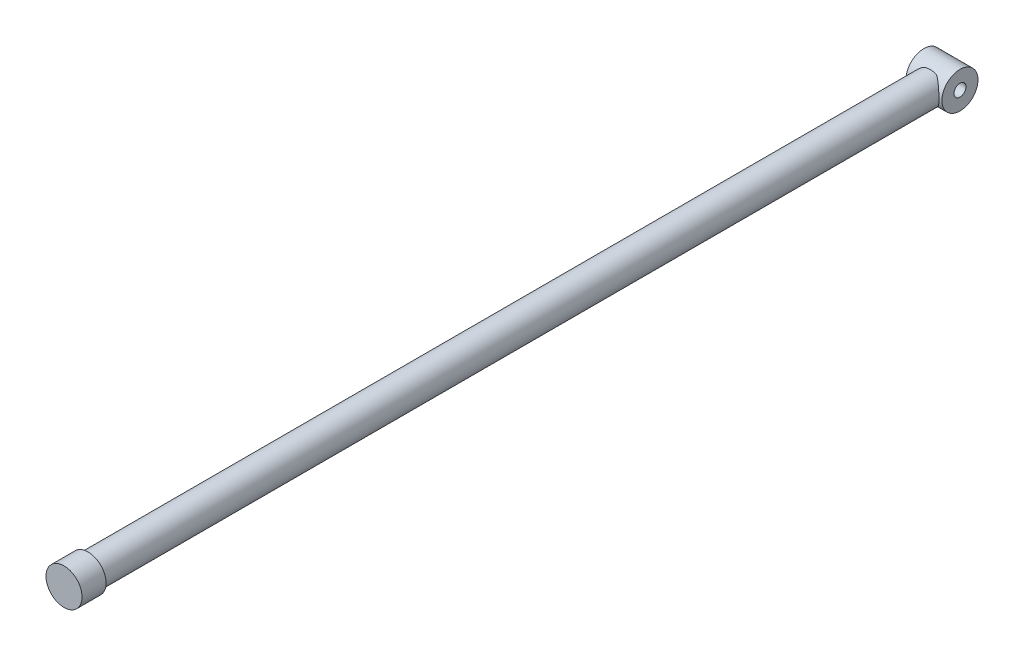
ISO-10303-21;
HEADER;
FILE_DESCRIPTION(('STEP AP214'),'2;1');
FILE_NAME('part.step','',(''),(''),'','','');
FILE_SCHEMA(('AUTOMOTIVE_DESIGN { 1 0 10303 214 1 1 1 1 }'));
ENDSEC;
DATA;
#1=APPLICATION_CONTEXT('core data for automotive mechanical design processes');
#2=APPLICATION_PROTOCOL_DEFINITION('international standard','automotive_design',2000,#1);
#3=PRODUCT_CONTEXT('',#1,'mechanical');
#4=PRODUCT('Part','Part','',(#3));
#5=PRODUCT_RELATED_PRODUCT_CATEGORY('part','',(#4));
#6=PRODUCT_DEFINITION_FORMATION('','',#4);
#7=PRODUCT_DEFINITION_CONTEXT('part definition',#1,'design');
#8=PRODUCT_DEFINITION('design','',#6,#7);
#9=PRODUCT_DEFINITION_SHAPE('','',#8);
#10=(LENGTH_UNIT() NAMED_UNIT(*) SI_UNIT(.MILLI.,.METRE.));
#11=(NAMED_UNIT(*) PLANE_ANGLE_UNIT() SI_UNIT($,.RADIAN.));
#12=(NAMED_UNIT(*) SI_UNIT($,.STERADIAN.) SOLID_ANGLE_UNIT());
#13=UNCERTAINTY_MEASURE_WITH_UNIT(LENGTH_MEASURE(1.E-05),#10,'distance_accuracy_value','');
#14=(GEOMETRIC_REPRESENTATION_CONTEXT(3) GLOBAL_UNCERTAINTY_ASSIGNED_CONTEXT((#13)) GLOBAL_UNIT_ASSIGNED_CONTEXT((#10,
#11,#12)) REPRESENTATION_CONTEXT('',''));
#15=CARTESIAN_POINT('',(0.,0.,0.));
#16=DIRECTION('',(0.,0.,1.));
#17=DIRECTION('',(1.,0.,0.));
#18=AXIS2_PLACEMENT_3D('',#15,#16,#17);
#19=CARTESIAN_POINT('',(0.,0.,-71.));
#20=DIRECTION('',(0.,0.,-1.));
#21=DIRECTION('',(-1.,0.,0.));
#22=AXIS2_PLACEMENT_3D('',#19,#20,#21);
#23=PLANE('',#22);
#24=DIRECTION('',(1.,0.,0.));
#25=VECTOR('',#24,1.);
#26=CARTESIAN_POINT('',(-1.5,1.1180339887499,-71.));
#27=LINE('',#26,#25);
#28=CARTESIAN_POINT('',(-0.559016994374931,1.1180339887499,-71.));
#29=VERTEX_POINT('',#28);
#30=CARTESIAN_POINT('',(0.559016994374931,1.1180339887499,-71.));
#31=VERTEX_POINT('',#30);
#32=EDGE_CURVE('E11',#29,#31,#27,.T.);
#33=ORIENTED_EDGE('',*,*,#32,.F.);
#34=CARTESIAN_POINT('',(0.,0.,-71.));
#35=DIRECTION('',(0.,0.,-1.));
#36=DIRECTION('',(-1.,0.,0.));
#37=AXIS2_PLACEMENT_3D('',#34,#35,#36);
#38=CIRCLE('',#37,1.25);
#39=EDGE_CURVE('E76',#29,#31,#38,.T.);
#40=ORIENTED_EDGE('',*,*,#39,.T.);
#41=EDGE_LOOP('',(#33,#40));
#42=FACE_BOUND('',#41,.T.);
#43=ADVANCED_FACE('F45',(#42),#23,.T.);
#44=CARTESIAN_POINT('',(0.,0.,1.));
#45=DIRECTION('',(0.,0.,-1.));
#46=DIRECTION('',(-1.,0.,0.));
#47=AXIS2_PLACEMENT_3D('',#44,#45,#46);
#48=CYLINDRICAL_SURFACE('',#47,1.5);
#49=CARTESIAN_POINT('',(0.,0.,1.));
#50=DIRECTION('',(0.,0.,1.));
#51=DIRECTION('',(1.,0.,0.));
#52=AXIS2_PLACEMENT_3D('',#49,#50,#51);
#53=CIRCLE('',#52,1.5);
#54=CARTESIAN_POINT('',(1.5,0.,1.));
#55=VERTEX_POINT('',#54);
#56=EDGE_CURVE('E92',#55,#55,#53,.T.);
#57=ORIENTED_EDGE('',*,*,#56,.F.);
#58=EDGE_LOOP('',(#57));
#59=FACE_BOUND('',#58,.T.);
#60=CARTESIAN_POINT('',(0.,0.,-1.));
#61=DIRECTION('',(0.,0.,1.));
#62=DIRECTION('',(1.,0.,0.));
#63=AXIS2_PLACEMENT_3D('',#60,#61,#62);
#64=CIRCLE('',#63,1.5);
#65=CARTESIAN_POINT('',(1.5,0.,-1.));
#66=VERTEX_POINT('',#65);
#67=EDGE_CURVE('E95',#66,#66,#64,.T.);
#68=ORIENTED_EDGE('',*,*,#67,.T.);
#69=EDGE_LOOP('',(#68));
#70=FACE_BOUND('',#69,.T.);
#71=ADVANCED_FACE('F47',(#59,#70),#48,.T.);
#72=CARTESIAN_POINT('',(0.,0.,1.));
#73=DIRECTION('',(0.,0.,1.));
#74=DIRECTION('',(1.,0.,0.));
#75=AXIS2_PLACEMENT_3D('',#72,#73,#74);
#76=PLANE('',#75);
#77=ORIENTED_EDGE('',*,*,#56,.T.);
#78=EDGE_LOOP('',(#77));
#79=FACE_BOUND('',#78,.T.);
#80=ADVANCED_FACE('F135',(#79),#76,.T.);
#81=CARTESIAN_POINT('',(0.,0.,-1.));
#82=DIRECTION('',(0.,0.,1.));
#83=DIRECTION('',(1.,0.,0.));
#84=AXIS2_PLACEMENT_3D('',#81,#82,#83);
#85=PLANE('',#84);
#86=CARTESIAN_POINT('',(0.,0.,-1.));
#87=DIRECTION('',(0.,0.,-1.));
#88=DIRECTION('',(-1.,0.,0.));
#89=AXIS2_PLACEMENT_3D('',#86,#87,#88);
#90=CIRCLE('',#89,1.25);
#91=CARTESIAN_POINT('',(-1.25,0.,-1.));
#92=VERTEX_POINT('',#91);
#93=EDGE_CURVE('E89',#92,#92,#90,.T.);
#94=ORIENTED_EDGE('',*,*,#93,.F.);
#95=EDGE_LOOP('',(#94));
#96=FACE_BOUND('',#95,.T.);
#97=ORIENTED_EDGE('',*,*,#67,.F.);
#98=EDGE_LOOP('',(#97));
#99=FACE_BOUND('',#98,.T.);
#100=ADVANCED_FACE('F129',(#96,#99),#85,.F.);
#101=CARTESIAN_POINT('',(0.,0.,-71.));
#102=DIRECTION('',(0.,0.,1.));
#103=DIRECTION('',(1.,0.,0.));
#104=AXIS2_PLACEMENT_3D('',#101,#102,#103);
#105=CYLINDRICAL_SURFACE('',#104,1.25);
#106=CARTESIAN_POINT('',(0.559016994374931,-1.1180339887499,-71.));
#107=VERTEX_POINT('',#106);
#108=CARTESIAN_POINT('',(-0.559016994374931,-1.1180339887499,-71.));
#109=VERTEX_POINT('',#108);
#110=EDGE_CURVE('E72',#107,#109,#38,.T.);
#111=ORIENTED_EDGE('',*,*,#110,.F.);
#112=CARTESIAN_POINT('',(0.559016994374931,-1.1180339887499,-71.));
#113=CARTESIAN_POINT('',(0.593811635344597,-1.10061806442588,-70.9805132598228));
#114=CARTESIAN_POINT('',(0.627533050357169,-1.08174407638237,-70.9604499757101));
#115=CARTESIAN_POINT('',(0.692870066810295,-1.0411161683683,-70.9197707023673));
#116=CARTESIAN_POINT('',(0.724484699822695,-1.01936093751207,-70.8991544649842));
#117=CARTESIAN_POINT('',(0.785860465048289,-0.972838228553443,-70.8578246726395));
#118=CARTESIAN_POINT('',(0.81560483316899,-0.948048143409763,-70.837111650001));
#119=CARTESIAN_POINT('',(0.872862085988988,-0.89561111579206,-70.7962619451478));
#120=CARTESIAN_POINT('',(0.900375568406183,-0.867964943089832,-70.7761251094982));
#121=CARTESIAN_POINT('',(0.969875806533156,-0.791188294761078,-70.7243325845818));
#122=CARTESIAN_POINT('',(1.00987496618825,-0.739618990336229,-70.6935397985703));
#123=CARTESIAN_POINT('',(1.08215411508672,-0.629108316130042,-70.6368936361563));
#124=CARTESIAN_POINT('',(1.11446004304221,-0.57019276924534,-70.6110237226948));
#125=CARTESIAN_POINT('',(1.16472101850465,-0.457178395897959,-70.5703495337047));
#126=CARTESIAN_POINT('',(1.18422337211217,-0.404191329565808,-70.5543847229982));
#127=CARTESIAN_POINT('',(1.21609063067817,-0.294731192199186,-70.5281665089475));
#128=CARTESIAN_POINT('',(1.22845753448095,-0.238259102331445,-70.5179115061504));
#129=CARTESIAN_POINT('',(1.24529297222234,-0.123069662582556,-70.5039277247497));
#130=CARTESIAN_POINT('',(1.24972564821476,-0.0643433385309655,-70.500228575407));
#131=CARTESIAN_POINT('',(1.25024938539999,0.0531705278087508,-70.499792229876));
#132=CARTESIAN_POINT('',(1.24634147624605,0.11195806164497,-70.5030541743339));
#133=CARTESIAN_POINT('',(1.23108449653817,0.223271671693049,-70.5157314393465));
#134=CARTESIAN_POINT('',(1.22031787904697,0.275935912992409,-70.5246649355085));
#135=CARTESIAN_POINT('',(1.1925291814653,0.378410373684878,-70.5475661293957));
#136=CARTESIAN_POINT('',(1.1755069501463,0.428220524047123,-70.5615339488247));
#137=CARTESIAN_POINT('',(1.13449025374567,0.527775581869345,-70.5948616094247));
#138=CARTESIAN_POINT('',(1.11006647127366,0.57723172845044,-70.6145488869434));
#139=CARTESIAN_POINT('',(1.05580848599811,0.671361753931853,-70.6576288437541));
#140=CARTESIAN_POINT('',(1.02596689135404,0.716028964918001,-70.6810265798563));
#141=CARTESIAN_POINT('',(0.946290353752714,0.820476227695371,-70.7422128483682));
#142=CARTESIAN_POINT('',(0.893717359927154,0.877273043475977,-70.7815337593059));
#143=CARTESIAN_POINT('',(0.780106476414995,0.979690540155688,-70.8622645798975));
#144=CARTESIAN_POINT('',(0.719073462217315,1.02531761655308,-70.9036732776819));
#145=CARTESIAN_POINT('',(0.638615223507825,1.07470622397653,-70.9534872786362));
#146=CARTESIAN_POINT('',(0.623009324567282,1.08382988216806,-70.9629470749396));
#147=CARTESIAN_POINT('',(0.59135592906316,1.10141999650187,-70.9816495632211));
#148=CARTESIAN_POINT('',(0.575309360322809,1.10988770860272,-70.9908926452207));
#149=CARTESIAN_POINT('',(0.559016994375566,1.11803398875141,-70.9999999999995));
#150=B_SPLINE_CURVE_WITH_KNOTS('',3,(#112,#113,#114,#115,#116,#117,#118,#119,#120,#121,#122,
#123,#124,#125,#126,#127,#128,#129,#130,#131,#132,#133,#134,#135,#136,#137,#138,#139,#140,#141,
#142,#143,#144,#145,#146,#147,#148,#149),.UNSPECIFIED.,.F.,.F.,(4,2,2,2,2,2,2,2,2,2,2,2,2,2,2,2,
2,2,4),(0.,0.130485614831924,0.261030802269521,0.392615521128765,0.524164867385228,
0.739784958918597,0.954667427152363,1.12996833178603,1.30522010573319,1.48126193160863,
1.65728202620879,1.8200483466679,1.98281860223685,2.15787596791479,2.33317399451222,
2.59227356874167,2.85122444056857,2.91242235677351,2.97350004024471),.UNSPECIFIED.);
#151=EDGE_CURVE('E66',#107,#31,#150,.T.);
#152=ORIENTED_EDGE('',*,*,#151,.T.);
#153=ORIENTED_EDGE('',*,*,#39,.F.);
#154=CARTESIAN_POINT('',(-0.559016994374931,1.1180339887499,-71.));
#155=CARTESIAN_POINT('',(-0.593811635344597,1.10061806442588,-70.9805132598228));
#156=CARTESIAN_POINT('',(-0.627533050357169,1.08174407638237,-70.9604499757101));
#157=CARTESIAN_POINT('',(-0.692870066810295,1.0411161683683,-70.9197707023673));
#158=CARTESIAN_POINT('',(-0.724484699822695,1.01936093751207,-70.8991544649842));
#159=CARTESIAN_POINT('',(-0.785860465048289,0.972838228553443,-70.8578246726395));
#160=CARTESIAN_POINT('',(-0.81560483316899,0.948048143409763,-70.837111650001));
#161=CARTESIAN_POINT('',(-0.872862085988988,0.89561111579206,-70.7962619451478));
#162=CARTESIAN_POINT('',(-0.900375568406183,0.867964943089832,-70.7761251094982));
#163=CARTESIAN_POINT('',(-0.969875806533156,0.791188294761078,-70.7243325845818));
#164=CARTESIAN_POINT('',(-1.00987496618825,0.739618990336229,-70.6935397985703));
#165=CARTESIAN_POINT('',(-1.08215411508672,0.629108316130042,-70.6368936361563));
#166=CARTESIAN_POINT('',(-1.11446004304221,0.57019276924534,-70.6110237226948));
#167=CARTESIAN_POINT('',(-1.16472101850465,0.457178395897959,-70.5703495337047));
#168=CARTESIAN_POINT('',(-1.18422337211217,0.404191329565808,-70.5543847229982));
#169=CARTESIAN_POINT('',(-1.21609063067817,0.294731192199186,-70.5281665089475));
#170=CARTESIAN_POINT('',(-1.22845753448095,0.238259102331445,-70.5179115061504));
#171=CARTESIAN_POINT('',(-1.24529297222234,0.123069662582556,-70.5039277247497));
#172=CARTESIAN_POINT('',(-1.24972564821476,0.0643433385309655,-70.500228575407));
#173=CARTESIAN_POINT('',(-1.25024938539999,-0.0531705278087508,-70.499792229876));
#174=CARTESIAN_POINT('',(-1.24634147624605,-0.11195806164497,-70.5030541743339));
#175=CARTESIAN_POINT('',(-1.23108449653817,-0.223271671693049,-70.5157314393465));
#176=CARTESIAN_POINT('',(-1.22031787904697,-0.275935912992409,-70.5246649355085));
#177=CARTESIAN_POINT('',(-1.1925291814653,-0.378410373684878,-70.5475661293957));
#178=CARTESIAN_POINT('',(-1.1755069501463,-0.428220524047123,-70.5615339488247));
#179=CARTESIAN_POINT('',(-1.13449025374567,-0.527775581869345,-70.5948616094247));
#180=CARTESIAN_POINT('',(-1.11006647127366,-0.57723172845044,-70.6145488869434));
#181=CARTESIAN_POINT('',(-1.05580848599811,-0.671361753931853,-70.6576288437541));
#182=CARTESIAN_POINT('',(-1.02596689135404,-0.716028964918001,-70.6810265798563));
#183=CARTESIAN_POINT('',(-0.946290353752714,-0.820476227695371,-70.7422128483682));
#184=CARTESIAN_POINT('',(-0.893717359927154,-0.877273043475977,-70.7815337593059));
#185=CARTESIAN_POINT('',(-0.780106476414995,-0.979690540155688,-70.8622645798975));
#186=CARTESIAN_POINT('',(-0.719073462217315,-1.02531761655308,-70.9036732776819));
#187=CARTESIAN_POINT('',(-0.638615223507825,-1.07470622397653,-70.9534872786362));
#188=CARTESIAN_POINT('',(-0.623009324567282,-1.08382988216806,-70.9629470749396));
#189=CARTESIAN_POINT('',(-0.59135592906316,-1.10141999650187,-70.9816495632211));
#190=CARTESIAN_POINT('',(-0.575309360322809,-1.10988770860272,-70.9908926452207));
#191=CARTESIAN_POINT('',(-0.559016994375566,-1.11803398875141,-70.9999999999995));
#192=B_SPLINE_CURVE_WITH_KNOTS('',3,(#154,#155,#156,#157,#158,#159,#160,#161,#162,#163,#164,
#165,#166,#167,#168,#169,#170,#171,#172,#173,#174,#175,#176,#177,#178,#179,#180,#181,#182,#183,
#184,#185,#186,#187,#188,#189,#190,#191),.UNSPECIFIED.,.F.,.F.,(4,2,2,2,2,2,2,2,2,2,2,2,2,2,2,2,
2,2,4),(0.,0.130485614831924,0.261030802269521,0.392615521128765,0.524164867385228,
0.739784958918597,0.954667427152363,1.12996833178603,1.30522010573319,1.48126193160863,
1.65728202620879,1.8200483466679,1.98281860223685,2.15787596791479,2.33317399451222,
2.59227356874167,2.85122444056857,2.91242235677351,2.97350004024471),.UNSPECIFIED.);
#193=EDGE_CURVE('E79',#29,#109,#192,.T.);
#194=ORIENTED_EDGE('',*,*,#193,.T.);
#195=EDGE_LOOP('',(#111,#152,#153,#194));
#196=FACE_BOUND('',#195,.T.);
#197=ORIENTED_EDGE('',*,*,#93,.T.);
#198=EDGE_LOOP('',(#197));
#199=FACE_BOUND('',#198,.T.);
#200=ADVANCED_FACE('F80',(#196,#199),#105,.T.);
#201=DIRECTION('',(1.,0.,0.));
#202=VECTOR('',#201,1.);
#203=CARTESIAN_POINT('',(-1.5,-1.1180339887499,-71.));
#204=LINE('',#203,#202);
#205=EDGE_CURVE('E54',#107,#109,#204,.F.);
#206=ORIENTED_EDGE('',*,*,#205,.F.);
#207=ORIENTED_EDGE('',*,*,#110,.T.);
#208=EDGE_LOOP('',(#206,#207));
#209=FACE_BOUND('',#208,.T.);
#210=ADVANCED_FACE('F74',(#209),#23,.T.);
#211=CARTESIAN_POINT('',(-1.5,0.,-72.));
#212=DIRECTION('',(1.,0.,0.));
#213=DIRECTION('',(0.,0.,-1.));
#214=AXIS2_PLACEMENT_3D('',#211,#212,#213);
#215=CYLINDRICAL_SURFACE('',#214,1.5);
#216=ORIENTED_EDGE('',*,*,#193,.F.);
#217=ORIENTED_EDGE('',*,*,#32,.T.);
#218=ORIENTED_EDGE('',*,*,#151,.F.);
#219=ORIENTED_EDGE('',*,*,#205,.T.);
#220=EDGE_LOOP('',(#216,#217,#218,#219));
#221=FACE_BOUND('',#220,.T.);
#222=CARTESIAN_POINT('',(-1.5,0.,-72.));
#223=DIRECTION('',(1.,0.,0.));
#224=DIRECTION('',(0.,0.,-1.));
#225=AXIS2_PLACEMENT_3D('',#222,#223,#224);
#226=CIRCLE('',#225,1.5);
#227=CARTESIAN_POINT('',(-1.5,0.,-73.5));
#228=VERTEX_POINT('',#227);
#229=EDGE_CURVE('E84',#228,#228,#226,.T.);
#230=ORIENTED_EDGE('',*,*,#229,.T.);
#231=EDGE_LOOP('',(#230));
#232=FACE_BOUND('',#231,.T.);
#233=CARTESIAN_POINT('',(1.5,0.,-72.));
#234=DIRECTION('',(1.,0.,0.));
#235=DIRECTION('',(0.,0.,-1.));
#236=AXIS2_PLACEMENT_3D('',#233,#234,#235);
#237=CIRCLE('',#236,1.5);
#238=CARTESIAN_POINT('',(1.5,0.,-73.5));
#239=VERTEX_POINT('',#238);
#240=EDGE_CURVE('E240',#239,#239,#237,.T.);
#241=ORIENTED_EDGE('',*,*,#240,.F.);
#242=EDGE_LOOP('',(#241));
#243=FACE_BOUND('',#242,.T.);
#244=ADVANCED_FACE('F86',(#221,#232,#243),#215,.T.);
#245=CARTESIAN_POINT('',(-1.5,0.,-72.));
#246=DIRECTION('',(1.,0.,0.));
#247=DIRECTION('',(0.,0.,-1.));
#248=AXIS2_PLACEMENT_3D('',#245,#246,#247);
#249=PLANE('',#248);
#250=CARTESIAN_POINT('',(-1.5,0.,-72.));
#251=DIRECTION('',(1.,0.,0.));
#252=DIRECTION('',(0.,0.,-1.));
#253=AXIS2_PLACEMENT_3D('',#250,#251,#252);
#254=CIRCLE('',#253,0.499999999999999);
#255=CARTESIAN_POINT('',(-1.5,0.,-72.5));
#256=VERTEX_POINT('',#255);
#257=EDGE_CURVE('E233',#256,#256,#254,.T.);
#258=ORIENTED_EDGE('',*,*,#257,.T.);
#259=EDGE_LOOP('',(#258));
#260=FACE_BOUND('',#259,.T.);
#261=ORIENTED_EDGE('',*,*,#229,.F.);
#262=EDGE_LOOP('',(#261));
#263=FACE_BOUND('',#262,.T.);
#264=ADVANCED_FACE('F121',(#260,#263),#249,.F.);
#265=CARTESIAN_POINT('',(1.5,0.,-72.));
#266=DIRECTION('',(1.,0.,0.));
#267=DIRECTION('',(0.,0.,-1.));
#268=AXIS2_PLACEMENT_3D('',#265,#266,#267);
#269=PLANE('',#268);
#270=CARTESIAN_POINT('',(1.5,0.,-72.));
#271=DIRECTION('',(1.,0.,0.));
#272=DIRECTION('',(0.,0.,-1.));
#273=AXIS2_PLACEMENT_3D('',#270,#271,#272);
#274=CIRCLE('',#273,0.499999999999999);
#275=CARTESIAN_POINT('',(1.5,0.,-72.5));
#276=VERTEX_POINT('',#275);
#277=EDGE_CURVE('E236',#276,#276,#274,.T.);
#278=ORIENTED_EDGE('',*,*,#277,.F.);
#279=EDGE_LOOP('',(#278));
#280=FACE_BOUND('',#279,.T.);
#281=ORIENTED_EDGE('',*,*,#240,.T.);
#282=EDGE_LOOP('',(#281));
#283=FACE_BOUND('',#282,.T.);
#284=ADVANCED_FACE('F122',(#280,#283),#269,.T.);
#285=CARTESIAN_POINT('',(-1.5,0.,-72.));
#286=DIRECTION('',(1.,0.,0.));
#287=DIRECTION('',(0.,0.,-1.));
#288=AXIS2_PLACEMENT_3D('',#285,#286,#287);
#289=CYLINDRICAL_SURFACE('',#288,0.499999999999999);
#290=ORIENTED_EDGE('',*,*,#257,.F.);
#291=EDGE_LOOP('',(#290));
#292=FACE_BOUND('',#291,.T.);
#293=ORIENTED_EDGE('',*,*,#277,.T.);
#294=EDGE_LOOP('',(#293));
#295=FACE_BOUND('',#294,.T.);
#296=ADVANCED_FACE('F190',(#292,#295),#289,.F.);
#297=CLOSED_SHELL('',(#43,#71,#80,#100,#200,#210,#244,#264,#284,#296));
#298=MANIFOLD_SOLID_BREP('B2',#297);
#299=ADVANCED_BREP_SHAPE_REPRESENTATION('',(#18,#298),#14);
#300=SHAPE_DEFINITION_REPRESENTATION(#9,#299);
ENDSEC;
END-ISO-10303-21;
